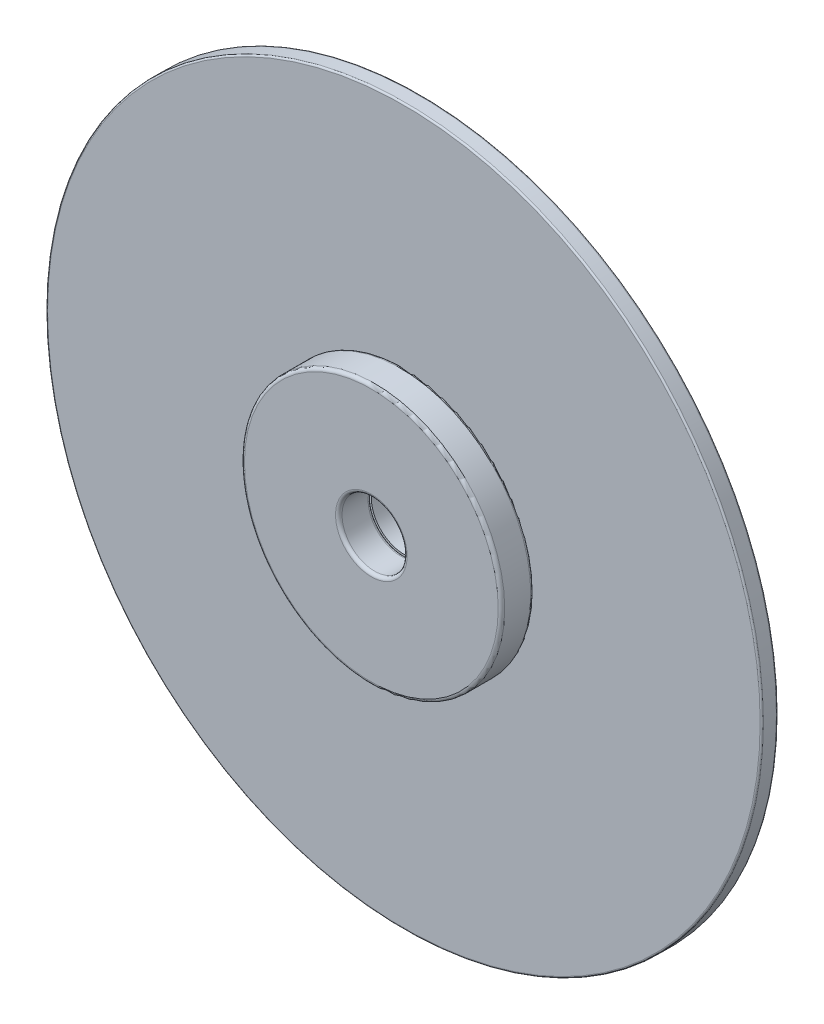
ISO-10303-21;
HEADER;
FILE_DESCRIPTION(('STEP AP214'),'2;1');
FILE_NAME('part.step','',(''),(''),'','','');
FILE_SCHEMA(('AUTOMOTIVE_DESIGN { 1 0 10303 214 1 1 1 1 }'));
ENDSEC;
DATA;
#1=APPLICATION_CONTEXT('core data for automotive mechanical design processes');
#2=APPLICATION_PROTOCOL_DEFINITION('international standard','automotive_design',2000,#1);
#3=PRODUCT_CONTEXT('',#1,'mechanical');
#4=PRODUCT('Part','Part','',(#3));
#5=PRODUCT_RELATED_PRODUCT_CATEGORY('part','',(#4));
#6=PRODUCT_DEFINITION_FORMATION('','',#4);
#7=PRODUCT_DEFINITION_CONTEXT('part definition',#1,'design');
#8=PRODUCT_DEFINITION('design','',#6,#7);
#9=PRODUCT_DEFINITION_SHAPE('','',#8);
#10=(LENGTH_UNIT() NAMED_UNIT(*) SI_UNIT(.MILLI.,.METRE.));
#11=(NAMED_UNIT(*) PLANE_ANGLE_UNIT() SI_UNIT($,.RADIAN.));
#12=(NAMED_UNIT(*) SI_UNIT($,.STERADIAN.) SOLID_ANGLE_UNIT());
#13=UNCERTAINTY_MEASURE_WITH_UNIT(LENGTH_MEASURE(1.E-05),#10,'distance_accuracy_value','');
#14=(GEOMETRIC_REPRESENTATION_CONTEXT(3) GLOBAL_UNCERTAINTY_ASSIGNED_CONTEXT((#13)) GLOBAL_UNIT_ASSIGNED_CONTEXT((#10,
#11,#12)) REPRESENTATION_CONTEXT('',''));
#15=CARTESIAN_POINT('',(0.,0.,0.));
#16=DIRECTION('',(0.,0.,1.));
#17=DIRECTION('',(1.,0.,0.));
#18=AXIS2_PLACEMENT_3D('',#15,#16,#17);
#19=CARTESIAN_POINT('',(0.,0.,-1.));
#20=DIRECTION('',(0.,0.,-1.));
#21=DIRECTION('',(-1.,0.,0.));
#22=AXIS2_PLACEMENT_3D('',#19,#20,#21);
#23=PLANE('',#22);
#24=CARTESIAN_POINT('',(0.,0.,-1.));
#25=DIRECTION('',(0.,0.,-1.));
#26=DIRECTION('',(-1.,0.,0.));
#27=AXIS2_PLACEMENT_3D('',#24,#25,#26);
#28=CIRCLE('',#27,1.1);
#29=CARTESIAN_POINT('',(-1.1,0.,-1.));
#30=VERTEX_POINT('',#29);
#31=EDGE_CURVE('E58',#30,#30,#28,.F.);
#32=ORIENTED_EDGE('',*,*,#31,.T.);
#33=EDGE_LOOP('',(#32));
#34=FACE_BOUND('',#33,.T.);
#35=CARTESIAN_POINT('',(0.,0.,-1.));
#36=DIRECTION('',(0.,0.,-1.));
#37=DIRECTION('',(-1.,0.,0.));
#38=AXIS2_PLACEMENT_3D('',#35,#36,#37);
#39=CIRCLE('',#38,3.9);
#40=CARTESIAN_POINT('',(-3.9,0.,-1.));
#41=VERTEX_POINT('',#40);
#42=EDGE_CURVE('E63',#41,#41,#39,.T.);
#43=ORIENTED_EDGE('',*,*,#42,.T.);
#44=EDGE_LOOP('',(#43));
#45=FACE_BOUND('',#44,.T.);
#46=ADVANCED_FACE('F43',(#34,#45),#23,.T.);
#47=CARTESIAN_POINT('',(0.,0.,0.));
#48=DIRECTION('',(0.,0.,-1.));
#49=DIRECTION('',(-1.,0.,0.));
#50=AXIS2_PLACEMENT_3D('',#47,#48,#49);
#51=PLANE('',#50);
#52=CARTESIAN_POINT('',(0.,0.,0.));
#53=DIRECTION('',(0.,0.,-1.));
#54=DIRECTION('',(-1.,0.,0.));
#55=AXIS2_PLACEMENT_3D('',#52,#53,#54);
#56=CIRCLE('',#55,3.9);
#57=CARTESIAN_POINT('',(-3.9,0.,0.));
#58=VERTEX_POINT('',#57);
#59=EDGE_CURVE('E11',#58,#58,#56,.F.);
#60=ORIENTED_EDGE('',*,*,#59,.T.);
#61=EDGE_LOOP('',(#60));
#62=FACE_BOUND('',#61,.T.);
#63=CARTESIAN_POINT('',(0.,0.,0.));
#64=DIRECTION('',(0.,0.,-1.));
#65=DIRECTION('',(-1.,0.,0.));
#66=AXIS2_PLACEMENT_3D('',#63,#64,#65);
#67=CIRCLE('',#66,1.);
#68=CARTESIAN_POINT('',(-1.,0.,0.));
#69=VERTEX_POINT('',#68);
#70=EDGE_CURVE('E69',#69,#69,#67,.T.);
#71=ORIENTED_EDGE('',*,*,#70,.T.);
#72=EDGE_LOOP('',(#71));
#73=FACE_BOUND('',#72,.T.);
#74=ADVANCED_FACE('F73',(#62,#73),#51,.F.);
#75=CARTESIAN_POINT('',(0.,0.,-1.));
#76=DIRECTION('',(0.,0.,1.));
#77=DIRECTION('',(1.,0.,0.));
#78=AXIS2_PLACEMENT_3D('',#75,#76,#77);
#79=CYLINDRICAL_SURFACE('',#78,4.);
#80=CARTESIAN_POINT('',(0.,0.,-0.1));
#81=DIRECTION('',(0.,0.,-1.));
#82=DIRECTION('',(-1.,0.,0.));
#83=AXIS2_PLACEMENT_3D('',#80,#81,#82);
#84=CIRCLE('',#83,4.);
#85=CARTESIAN_POINT('',(-4.,0.,-0.1));
#86=VERTEX_POINT('',#85);
#87=EDGE_CURVE('E50',#86,#86,#84,.T.);
#88=ORIENTED_EDGE('',*,*,#87,.T.);
#89=EDGE_LOOP('',(#88));
#90=FACE_BOUND('',#89,.T.);
#91=CARTESIAN_POINT('',(0.,0.,-0.9));
#92=DIRECTION('',(0.,0.,-1.));
#93=DIRECTION('',(-1.,0.,0.));
#94=AXIS2_PLACEMENT_3D('',#91,#92,#93);
#95=CIRCLE('',#94,4.);
#96=CARTESIAN_POINT('',(-4.,0.,-0.9));
#97=VERTEX_POINT('',#96);
#98=EDGE_CURVE('E54',#97,#97,#95,.F.);
#99=ORIENTED_EDGE('',*,*,#98,.T.);
#100=EDGE_LOOP('',(#99));
#101=FACE_BOUND('',#100,.T.);
#102=ADVANCED_FACE('F78',(#90,#101),#79,.T.);
#103=CARTESIAN_POINT('',(0.,0.,-1.));
#104=DIRECTION('',(0.,0.,1.));
#105=DIRECTION('',(1.,0.,0.));
#106=AXIS2_PLACEMENT_3D('',#103,#104,#105);
#107=CYLINDRICAL_SURFACE('',#106,1.);
#108=CARTESIAN_POINT('',(0.,0.,-0.9));
#109=DIRECTION('',(0.,0.,-1.));
#110=DIRECTION('',(-1.,0.,0.));
#111=AXIS2_PLACEMENT_3D('',#108,#109,#110);
#112=CIRCLE('',#111,1.);
#113=CARTESIAN_POINT('',(-1.,0.,-0.9));
#114=VERTEX_POINT('',#113);
#115=EDGE_CURVE('E66',#114,#114,#112,.T.);
#116=ORIENTED_EDGE('',*,*,#115,.T.);
#117=EDGE_LOOP('',(#116));
#118=FACE_BOUND('',#117,.T.);
#119=ORIENTED_EDGE('',*,*,#70,.F.);
#120=EDGE_LOOP('',(#119));
#121=FACE_BOUND('',#120,.T.);
#122=ADVANCED_FACE('F75',(#118,#121),#107,.F.);
#123=CARTESIAN_POINT('',(0.,0.,-0.9));
#124=DIRECTION('',(0.,0.,-1.));
#125=DIRECTION('',(-1.,0.,0.));
#126=AXIS2_PLACEMENT_3D('',#123,#124,#125);
#127=TOROIDAL_SURFACE('',#126,1.1,0.1);
#128=ORIENTED_EDGE('',*,*,#31,.F.);
#129=EDGE_LOOP('',(#128));
#130=FACE_BOUND('',#129,.T.);
#131=ORIENTED_EDGE('',*,*,#115,.F.);
#132=EDGE_LOOP('',(#131));
#133=FACE_BOUND('',#132,.T.);
#134=ADVANCED_FACE('F77',(#130,#133),#127,.T.);
#135=CARTESIAN_POINT('',(0.,0.,-0.1));
#136=DIRECTION('',(0.,0.,-1.));
#137=DIRECTION('',(-1.,0.,0.));
#138=AXIS2_PLACEMENT_3D('',#135,#136,#137);
#139=TOROIDAL_SURFACE('',#138,3.9,0.1);
#140=ORIENTED_EDGE('',*,*,#59,.F.);
#141=EDGE_LOOP('',(#140));
#142=FACE_BOUND('',#141,.T.);
#143=ORIENTED_EDGE('',*,*,#87,.F.);
#144=EDGE_LOOP('',(#143));
#145=FACE_BOUND('',#144,.T.);
#146=ADVANCED_FACE('F85',(#142,#145),#139,.T.);
#147=CARTESIAN_POINT('',(0.,0.,-0.9));
#148=DIRECTION('',(0.,0.,-1.));
#149=DIRECTION('',(-1.,0.,0.));
#150=AXIS2_PLACEMENT_3D('',#147,#148,#149);
#151=TOROIDAL_SURFACE('',#150,3.9,0.1);
#152=ORIENTED_EDGE('',*,*,#98,.F.);
#153=EDGE_LOOP('',(#152));
#154=FACE_BOUND('',#153,.T.);
#155=ORIENTED_EDGE('',*,*,#42,.F.);
#156=EDGE_LOOP('',(#155));
#157=FACE_BOUND('',#156,.T.);
#158=ADVANCED_FACE('F45',(#154,#157),#151,.T.);
#159=CLOSED_SHELL('',(#46,#74,#102,#122,#134,#146,#158));
#160=MANIFOLD_SOLID_BREP('B2',#159);
#161=CARTESIAN_POINT('',(0.,0.,1.5));
#162=DIRECTION('',(0.,0.,1.));
#163=DIRECTION('',(1.,0.,0.));
#164=AXIS2_PLACEMENT_3D('',#161,#162,#163);
#165=PLANE('',#164);
#166=CARTESIAN_POINT('',(0.,0.,1.5));
#167=DIRECTION('',(0.,0.,1.));
#168=DIRECTION('',(1.,0.,0.));
#169=AXIS2_PLACEMENT_3D('',#166,#167,#168);
#170=CIRCLE('',#169,1.1);
#171=CARTESIAN_POINT('',(1.1,0.,1.5));
#172=VERTEX_POINT('',#171);
#173=EDGE_CURVE('E42',#172,#172,#170,.F.);
#174=ORIENTED_EDGE('',*,*,#173,.T.);
#175=EDGE_LOOP('',(#174));
#176=FACE_BOUND('',#175,.T.);
#177=CARTESIAN_POINT('',(0.,0.,1.5));
#178=DIRECTION('',(0.,0.,1.));
#179=DIRECTION('',(1.,0.,0.));
#180=AXIS2_PLACEMENT_3D('',#177,#178,#179);
#181=CIRCLE('',#180,3.9);
#182=CARTESIAN_POINT('',(3.9,0.,1.5));
#183=VERTEX_POINT('',#182);
#184=EDGE_CURVE('E163',#183,#183,#181,.T.);
#185=ORIENTED_EDGE('',*,*,#184,.T.);
#186=EDGE_LOOP('',(#185));
#187=FACE_BOUND('',#186,.T.);
#188=ADVANCED_FACE('F156',(#176,#187),#165,.T.);
#189=CARTESIAN_POINT('',(0.,0.,0.5));
#190=DIRECTION('',(0.,0.,1.));
#191=DIRECTION('',(1.,0.,0.));
#192=AXIS2_PLACEMENT_3D('',#189,#190,#191);
#193=PLANE('',#192);
#194=CARTESIAN_POINT('',(0.,0.,0.5));
#195=DIRECTION('',(0.,0.,1.));
#196=DIRECTION('',(1.,0.,0.));
#197=AXIS2_PLACEMENT_3D('',#194,#195,#196);
#198=CIRCLE('',#197,1.1);
#199=CARTESIAN_POINT('',(1.1,0.,0.5));
#200=VERTEX_POINT('',#199);
#201=EDGE_CURVE('E182',#200,#200,#198,.T.);
#202=ORIENTED_EDGE('',*,*,#201,.T.);
#203=EDGE_LOOP('',(#202));
#204=FACE_BOUND('',#203,.T.);
#205=CARTESIAN_POINT('',(0.,0.,0.5));
#206=DIRECTION('',(0.,0.,1.));
#207=DIRECTION('',(1.,0.,0.));
#208=AXIS2_PLACEMENT_3D('',#205,#206,#207);
#209=CIRCLE('',#208,3.9);
#210=CARTESIAN_POINT('',(3.9,0.,0.5));
#211=VERTEX_POINT('',#210);
#212=EDGE_CURVE('E185',#211,#211,#209,.F.);
#213=ORIENTED_EDGE('',*,*,#212,.T.);
#214=EDGE_LOOP('',(#213));
#215=FACE_BOUND('',#214,.T.);
#216=ADVANCED_FACE('F189',(#204,#215),#193,.F.);
#217=CARTESIAN_POINT('',(0.,0.,1.5));
#218=DIRECTION('',(0.,0.,-1.));
#219=DIRECTION('',(-1.,0.,0.));
#220=AXIS2_PLACEMENT_3D('',#217,#218,#219);
#221=CYLINDRICAL_SURFACE('',#220,4.);
#222=CARTESIAN_POINT('',(0.,0.,0.6));
#223=DIRECTION('',(0.,0.,1.));
#224=DIRECTION('',(1.,0.,0.));
#225=AXIS2_PLACEMENT_3D('',#222,#223,#224);
#226=CIRCLE('',#225,4.);
#227=CARTESIAN_POINT('',(4.,0.,0.6));
#228=VERTEX_POINT('',#227);
#229=EDGE_CURVE('E167',#228,#228,#226,.T.);
#230=ORIENTED_EDGE('',*,*,#229,.T.);
#231=EDGE_LOOP('',(#230));
#232=FACE_BOUND('',#231,.T.);
#233=CARTESIAN_POINT('',(0.,0.,1.4));
#234=DIRECTION('',(0.,0.,1.));
#235=DIRECTION('',(1.,0.,0.));
#236=AXIS2_PLACEMENT_3D('',#233,#234,#235);
#237=CIRCLE('',#236,4.);
#238=CARTESIAN_POINT('',(4.,0.,1.4));
#239=VERTEX_POINT('',#238);
#240=EDGE_CURVE('E171',#239,#239,#237,.F.);
#241=ORIENTED_EDGE('',*,*,#240,.T.);
#242=EDGE_LOOP('',(#241));
#243=FACE_BOUND('',#242,.T.);
#244=ADVANCED_FACE('F199',(#232,#243),#221,.T.);
#245=CARTESIAN_POINT('',(0.,0.,1.5));
#246=DIRECTION('',(0.,0.,-1.));
#247=DIRECTION('',(-1.,0.,0.));
#248=AXIS2_PLACEMENT_3D('',#245,#246,#247);
#249=CYLINDRICAL_SURFACE('',#248,1.);
#250=CARTESIAN_POINT('',(0.,0.,0.6));
#251=DIRECTION('',(0.,0.,1.));
#252=DIRECTION('',(1.,0.,0.));
#253=AXIS2_PLACEMENT_3D('',#250,#251,#252);
#254=CIRCLE('',#253,1.);
#255=CARTESIAN_POINT('',(1.,0.,0.6));
#256=VERTEX_POINT('',#255);
#257=EDGE_CURVE('E176',#256,#256,#254,.F.);
#258=ORIENTED_EDGE('',*,*,#257,.T.);
#259=EDGE_LOOP('',(#258));
#260=FACE_BOUND('',#259,.T.);
#261=CARTESIAN_POINT('',(0.,0.,1.4));
#262=DIRECTION('',(0.,0.,1.));
#263=DIRECTION('',(1.,0.,0.));
#264=AXIS2_PLACEMENT_3D('',#261,#262,#263);
#265=CIRCLE('',#264,1.);
#266=CARTESIAN_POINT('',(1.,0.,1.4));
#267=VERTEX_POINT('',#266);
#268=EDGE_CURVE('E179',#267,#267,#265,.T.);
#269=ORIENTED_EDGE('',*,*,#268,.T.);
#270=EDGE_LOOP('',(#269));
#271=FACE_BOUND('',#270,.T.);
#272=ADVANCED_FACE('F202',(#260,#271),#249,.F.);
#273=CARTESIAN_POINT('',(0.,0.,0.6));
#274=DIRECTION('',(0.,0.,1.));
#275=DIRECTION('',(1.,0.,0.));
#276=AXIS2_PLACEMENT_3D('',#273,#274,#275);
#277=TOROIDAL_SURFACE('',#276,1.1,0.1);
#278=ORIENTED_EDGE('',*,*,#257,.F.);
#279=EDGE_LOOP('',(#278));
#280=FACE_BOUND('',#279,.T.);
#281=ORIENTED_EDGE('',*,*,#201,.F.);
#282=EDGE_LOOP('',(#281));
#283=FACE_BOUND('',#282,.T.);
#284=ADVANCED_FACE('F195',(#280,#283),#277,.T.);
#285=CARTESIAN_POINT('',(0.,0.,0.6));
#286=DIRECTION('',(0.,0.,1.));
#287=DIRECTION('',(1.,0.,0.));
#288=AXIS2_PLACEMENT_3D('',#285,#286,#287);
#289=TOROIDAL_SURFACE('',#288,3.9,0.1);
#290=ORIENTED_EDGE('',*,*,#212,.F.);
#291=EDGE_LOOP('',(#290));
#292=FACE_BOUND('',#291,.T.);
#293=ORIENTED_EDGE('',*,*,#229,.F.);
#294=EDGE_LOOP('',(#293));
#295=FACE_BOUND('',#294,.T.);
#296=ADVANCED_FACE('F191',(#292,#295),#289,.T.);
#297=CARTESIAN_POINT('',(0.,0.,1.4));
#298=DIRECTION('',(0.,0.,1.));
#299=DIRECTION('',(1.,0.,0.));
#300=AXIS2_PLACEMENT_3D('',#297,#298,#299);
#301=TOROIDAL_SURFACE('',#300,1.1,0.1);
#302=ORIENTED_EDGE('',*,*,#173,.F.);
#303=EDGE_LOOP('',(#302));
#304=FACE_BOUND('',#303,.T.);
#305=ORIENTED_EDGE('',*,*,#268,.F.);
#306=EDGE_LOOP('',(#305));
#307=FACE_BOUND('',#306,.T.);
#308=ADVANCED_FACE('F194',(#304,#307),#301,.T.);
#309=CARTESIAN_POINT('',(0.,0.,1.4));
#310=DIRECTION('',(0.,0.,1.));
#311=DIRECTION('',(1.,0.,0.));
#312=AXIS2_PLACEMENT_3D('',#309,#310,#311);
#313=TOROIDAL_SURFACE('',#312,3.9,0.1);
#314=ORIENTED_EDGE('',*,*,#240,.F.);
#315=EDGE_LOOP('',(#314));
#316=FACE_BOUND('',#315,.T.);
#317=ORIENTED_EDGE('',*,*,#184,.F.);
#318=EDGE_LOOP('',(#317));
#319=FACE_BOUND('',#318,.T.);
#320=ADVANCED_FACE('F158',(#316,#319),#313,.T.);
#321=CLOSED_SHELL('',(#188,#216,#244,#272,#284,#296,#308,#320));
#322=MANIFOLD_SOLID_BREP('B6',#321);
#323=CARTESIAN_POINT('',(0.,0.,0.5));
#324=DIRECTION('',(0.,0.,1.));
#325=DIRECTION('',(1.,0.,0.));
#326=AXIS2_PLACEMENT_3D('',#323,#324,#325);
#327=PLANE('',#326);
#328=CARTESIAN_POINT('',(0.,0.,0.5));
#329=DIRECTION('',(0.,0.,1.));
#330=DIRECTION('',(1.,0.,0.));
#331=AXIS2_PLACEMENT_3D('',#328,#329,#330);
#332=CIRCLE('',#331,10.95);
#333=CARTESIAN_POINT('',(10.95,0.,0.5));
#334=VERTEX_POINT('',#333);
#335=EDGE_CURVE('E155',#334,#334,#332,.T.);
#336=ORIENTED_EDGE('',*,*,#335,.T.);
#337=EDGE_LOOP('',(#336));
#338=FACE_BOUND('',#337,.T.);
#339=CARTESIAN_POINT('',(0.,0.,0.5));
#340=DIRECTION('',(0.,0.,1.));
#341=DIRECTION('',(1.,0.,0.));
#342=AXIS2_PLACEMENT_3D('',#339,#340,#341);
#343=CIRCLE('',#342,1.);
#344=CARTESIAN_POINT('',(1.,0.,0.5));
#345=VERTEX_POINT('',#344);
#346=EDGE_CURVE('E297',#345,#345,#343,.T.);
#347=ORIENTED_EDGE('',*,*,#346,.F.);
#348=EDGE_LOOP('',(#347));
#349=FACE_BOUND('',#348,.T.);
#350=ADVANCED_FACE('F277',(#338,#349),#327,.T.);
#351=CARTESIAN_POINT('',(0.,0.,0.));
#352=DIRECTION('',(0.,0.,1.));
#353=DIRECTION('',(1.,0.,0.));
#354=AXIS2_PLACEMENT_3D('',#351,#352,#353);
#355=PLANE('',#354);
#356=CARTESIAN_POINT('',(0.,0.,0.));
#357=DIRECTION('',(0.,0.,1.));
#358=DIRECTION('',(1.,0.,0.));
#359=AXIS2_PLACEMENT_3D('',#356,#357,#358);
#360=CIRCLE('',#359,10.95);
#361=CARTESIAN_POINT('',(10.95,0.,0.));
#362=VERTEX_POINT('',#361);
#363=EDGE_CURVE('E284',#362,#362,#360,.F.);
#364=ORIENTED_EDGE('',*,*,#363,.T.);
#365=EDGE_LOOP('',(#364));
#366=FACE_BOUND('',#365,.T.);
#367=CARTESIAN_POINT('',(0.,0.,0.));
#368=DIRECTION('',(0.,0.,1.));
#369=DIRECTION('',(1.,0.,0.));
#370=AXIS2_PLACEMENT_3D('',#367,#368,#369);
#371=CIRCLE('',#370,1.);
#372=CARTESIAN_POINT('',(1.,0.,0.));
#373=VERTEX_POINT('',#372);
#374=EDGE_CURVE('E298',#373,#373,#371,.T.);
#375=ORIENTED_EDGE('',*,*,#374,.T.);
#376=EDGE_LOOP('',(#375));
#377=FACE_BOUND('',#376,.T.);
#378=ADVANCED_FACE('F308',(#366,#377),#355,.F.);
#379=CARTESIAN_POINT('',(0.,0.,0.5));
#380=DIRECTION('',(0.,0.,-1.));
#381=DIRECTION('',(-1.,0.,0.));
#382=AXIS2_PLACEMENT_3D('',#379,#380,#381);
#383=CYLINDRICAL_SURFACE('',#382,11.);
#384=CARTESIAN_POINT('',(0.,0.,0.05));
#385=DIRECTION('',(0.,0.,1.));
#386=DIRECTION('',(1.,0.,0.));
#387=AXIS2_PLACEMENT_3D('',#384,#385,#386);
#388=CIRCLE('',#387,11.);
#389=CARTESIAN_POINT('',(11.,0.,0.05));
#390=VERTEX_POINT('',#389);
#391=EDGE_CURVE('E288',#390,#390,#388,.T.);
#392=ORIENTED_EDGE('',*,*,#391,.T.);
#393=EDGE_LOOP('',(#392));
#394=FACE_BOUND('',#393,.T.);
#395=CARTESIAN_POINT('',(0.,0.,0.45));
#396=DIRECTION('',(0.,0.,1.));
#397=DIRECTION('',(1.,0.,0.));
#398=AXIS2_PLACEMENT_3D('',#395,#396,#397);
#399=CIRCLE('',#398,11.);
#400=CARTESIAN_POINT('',(11.,0.,0.45));
#401=VERTEX_POINT('',#400);
#402=EDGE_CURVE('E292',#401,#401,#399,.F.);
#403=ORIENTED_EDGE('',*,*,#402,.T.);
#404=EDGE_LOOP('',(#403));
#405=FACE_BOUND('',#404,.T.);
#406=ADVANCED_FACE('F313',(#394,#405),#383,.T.);
#407=CARTESIAN_POINT('',(0.,0.,0.5));
#408=DIRECTION('',(0.,0.,-1.));
#409=DIRECTION('',(-1.,0.,0.));
#410=AXIS2_PLACEMENT_3D('',#407,#408,#409);
#411=CYLINDRICAL_SURFACE('',#410,1.);
#412=ORIENTED_EDGE('',*,*,#346,.T.);
#413=EDGE_LOOP('',(#412));
#414=FACE_BOUND('',#413,.T.);
#415=ORIENTED_EDGE('',*,*,#374,.F.);
#416=EDGE_LOOP('',(#415));
#417=FACE_BOUND('',#416,.T.);
#418=ADVANCED_FACE('F304',(#414,#417),#411,.F.);
#419=CARTESIAN_POINT('',(0.,0.,0.05));
#420=DIRECTION('',(0.,0.,1.));
#421=DIRECTION('',(1.,0.,0.));
#422=AXIS2_PLACEMENT_3D('',#419,#420,#421);
#423=TOROIDAL_SURFACE('',#422,10.95,0.05);
#424=ORIENTED_EDGE('',*,*,#363,.F.);
#425=EDGE_LOOP('',(#424));
#426=FACE_BOUND('',#425,.T.);
#427=ORIENTED_EDGE('',*,*,#391,.F.);
#428=EDGE_LOOP('',(#427));
#429=FACE_BOUND('',#428,.T.);
#430=ADVANCED_FACE('F319',(#426,#429),#423,.T.);
#431=CARTESIAN_POINT('',(0.,0.,0.45));
#432=DIRECTION('',(0.,0.,1.));
#433=DIRECTION('',(1.,0.,0.));
#434=AXIS2_PLACEMENT_3D('',#431,#432,#433);
#435=TOROIDAL_SURFACE('',#434,10.95,0.05);
#436=ORIENTED_EDGE('',*,*,#402,.F.);
#437=EDGE_LOOP('',(#436));
#438=FACE_BOUND('',#437,.T.);
#439=ORIENTED_EDGE('',*,*,#335,.F.);
#440=EDGE_LOOP('',(#439));
#441=FACE_BOUND('',#440,.T.);
#442=ADVANCED_FACE('F279',(#438,#441),#435,.T.);
#443=CLOSED_SHELL('',(#350,#378,#406,#418,#430,#442));
#444=MANIFOLD_SOLID_BREP('B37',#443);
#445=ADVANCED_BREP_SHAPE_REPRESENTATION('',(#18,#160,#322,#444),#14);
#446=SHAPE_DEFINITION_REPRESENTATION(#9,#445);
ENDSEC;
END-ISO-10303-21;
